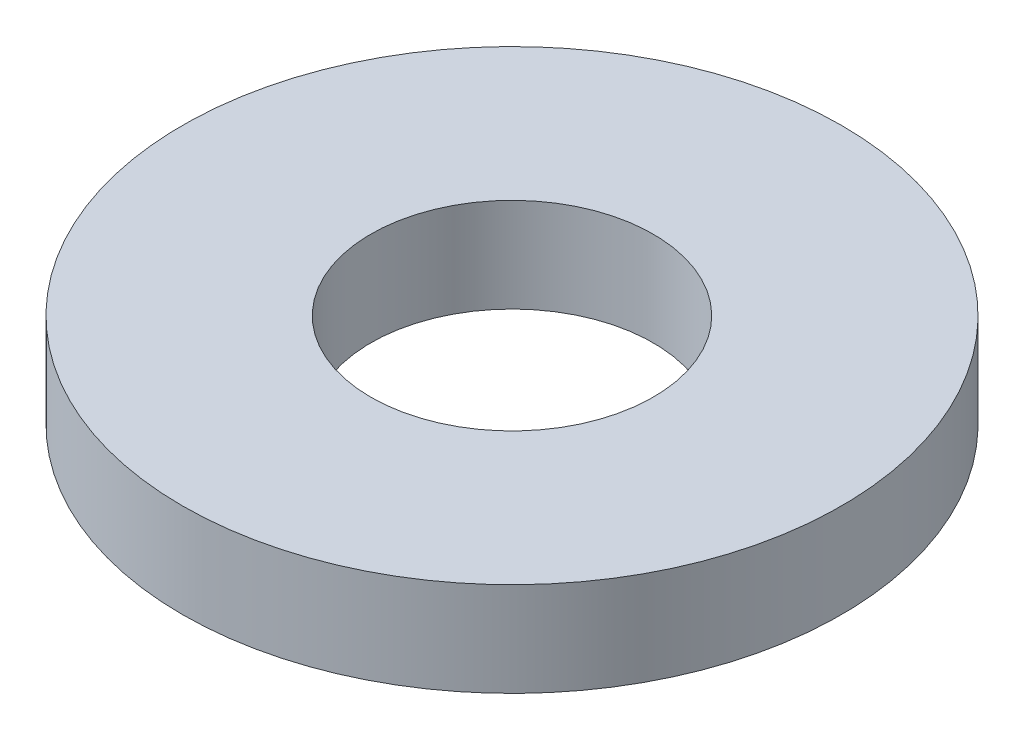
ISO-10303-21;
HEADER;
FILE_DESCRIPTION(('STEP AP214'),'2;1');
FILE_NAME('part.step','',(''),(''),'','','');
FILE_SCHEMA(('AUTOMOTIVE_DESIGN { 1 0 10303 214 1 1 1 1 }'));
ENDSEC;
DATA;
#1=APPLICATION_CONTEXT('core data for automotive mechanical design processes');
#2=APPLICATION_PROTOCOL_DEFINITION('international standard','automotive_design',2000,#1);
#3=PRODUCT_CONTEXT('',#1,'mechanical');
#4=PRODUCT('Part','Part','',(#3));
#5=PRODUCT_RELATED_PRODUCT_CATEGORY('part','',(#4));
#6=PRODUCT_DEFINITION_FORMATION('','',#4);
#7=PRODUCT_DEFINITION_CONTEXT('part definition',#1,'design');
#8=PRODUCT_DEFINITION('design','',#6,#7);
#9=PRODUCT_DEFINITION_SHAPE('','',#8);
#10=(LENGTH_UNIT() NAMED_UNIT(*) SI_UNIT(.MILLI.,.METRE.));
#11=(NAMED_UNIT(*) PLANE_ANGLE_UNIT() SI_UNIT($,.RADIAN.));
#12=(NAMED_UNIT(*) SI_UNIT($,.STERADIAN.) SOLID_ANGLE_UNIT());
#13=UNCERTAINTY_MEASURE_WITH_UNIT(LENGTH_MEASURE(1.E-05),#10,'distance_accuracy_value','');
#14=(GEOMETRIC_REPRESENTATION_CONTEXT(3) GLOBAL_UNCERTAINTY_ASSIGNED_CONTEXT((#13)) GLOBAL_UNIT_ASSIGNED_CONTEXT((#10,
#11,#12)) REPRESENTATION_CONTEXT('',''));
#15=CARTESIAN_POINT('',(0.,0.,0.));
#16=DIRECTION('',(0.,0.,1.));
#17=DIRECTION('',(1.,0.,0.));
#18=AXIS2_PLACEMENT_3D('',#15,#16,#17);
#19=CARTESIAN_POINT('',(0.,10.,0.));
#20=DIRECTION('',(0.,1.,0.));
#21=DIRECTION('',(0.,0.,1.));
#22=AXIS2_PLACEMENT_3D('',#19,#20,#21);
#23=PLANE('',#22);
#24=CARTESIAN_POINT('',(0.,10.,0.));
#25=DIRECTION('',(0.,1.,0.));
#26=DIRECTION('',(0.,0.,1.));
#27=AXIS2_PLACEMENT_3D('',#24,#25,#26);
#28=CIRCLE('',#27,35.);
#29=CARTESIAN_POINT('',(0.,10.,35.));
#30=VERTEX_POINT('',#29);
#31=EDGE_CURVE('E10',#30,#30,#28,.T.);
#32=ORIENTED_EDGE('',*,*,#31,.T.);
#33=EDGE_LOOP('',(#32));
#34=FACE_BOUND('',#33,.T.);
#35=CARTESIAN_POINT('',(0.,10.,0.));
#36=DIRECTION('',(0.,1.,0.));
#37=DIRECTION('',(0.,0.,1.));
#38=AXIS2_PLACEMENT_3D('',#35,#36,#37);
#39=CIRCLE('',#38,15.);
#40=CARTESIAN_POINT('',(0.,10.,15.));
#41=VERTEX_POINT('',#40);
#42=EDGE_CURVE('E50',#41,#41,#39,.T.);
#43=ORIENTED_EDGE('',*,*,#42,.F.);
#44=EDGE_LOOP('',(#43));
#45=FACE_BOUND('',#44,.T.);
#46=ADVANCED_FACE('F37',(#34,#45),#23,.T.);
#47=CARTESIAN_POINT('',(0.,0.,0.));
#48=DIRECTION('',(0.,1.,0.));
#49=DIRECTION('',(0.,0.,1.));
#50=AXIS2_PLACEMENT_3D('',#47,#48,#49);
#51=PLANE('',#50);
#52=CARTESIAN_POINT('',(0.,0.,0.));
#53=DIRECTION('',(0.,1.,0.));
#54=DIRECTION('',(0.,0.,1.));
#55=AXIS2_PLACEMENT_3D('',#52,#53,#54);
#56=CIRCLE('',#55,35.);
#57=CARTESIAN_POINT('',(0.,0.,35.));
#58=VERTEX_POINT('',#57);
#59=EDGE_CURVE('E41',#58,#58,#56,.T.);
#60=ORIENTED_EDGE('',*,*,#59,.F.);
#61=EDGE_LOOP('',(#60));
#62=FACE_BOUND('',#61,.T.);
#63=CARTESIAN_POINT('',(0.,0.,0.));
#64=DIRECTION('',(0.,1.,0.));
#65=DIRECTION('',(0.,0.,1.));
#66=AXIS2_PLACEMENT_3D('',#63,#64,#65);
#67=CIRCLE('',#66,15.);
#68=CARTESIAN_POINT('',(0.,0.,15.));
#69=VERTEX_POINT('',#68);
#70=EDGE_CURVE('E52',#69,#69,#67,.T.);
#71=ORIENTED_EDGE('',*,*,#70,.T.);
#72=EDGE_LOOP('',(#71));
#73=FACE_BOUND('',#72,.T.);
#74=ADVANCED_FACE('F64',(#62,#73),#51,.F.);
#75=CARTESIAN_POINT('',(0.,10.,0.));
#76=DIRECTION('',(0.,-1.,0.));
#77=DIRECTION('',(0.,0.,-1.));
#78=AXIS2_PLACEMENT_3D('',#75,#76,#77);
#79=CYLINDRICAL_SURFACE('',#78,35.);
#80=ORIENTED_EDGE('',*,*,#31,.F.);
#81=EDGE_LOOP('',(#80));
#82=FACE_BOUND('',#81,.T.);
#83=ORIENTED_EDGE('',*,*,#59,.T.);
#84=EDGE_LOOP('',(#83));
#85=FACE_BOUND('',#84,.T.);
#86=ADVANCED_FACE('F39',(#82,#85),#79,.T.);
#87=CARTESIAN_POINT('',(0.,10.,0.));
#88=DIRECTION('',(0.,-1.,0.));
#89=DIRECTION('',(0.,0.,-1.));
#90=AXIS2_PLACEMENT_3D('',#87,#88,#89);
#91=CYLINDRICAL_SURFACE('',#90,15.);
#92=ORIENTED_EDGE('',*,*,#42,.T.);
#93=EDGE_LOOP('',(#92));
#94=FACE_BOUND('',#93,.T.);
#95=ORIENTED_EDGE('',*,*,#70,.F.);
#96=EDGE_LOOP('',(#95));
#97=FACE_BOUND('',#96,.T.);
#98=ADVANCED_FACE('F60',(#94,#97),#91,.F.);
#99=CLOSED_SHELL('',(#46,#74,#86,#98));
#100=MANIFOLD_SOLID_BREP('B2',#99);
#101=ADVANCED_BREP_SHAPE_REPRESENTATION('',(#18,#100),#14);
#102=SHAPE_DEFINITION_REPRESENTATION(#9,#101);
ENDSEC;
END-ISO-10303-21;
